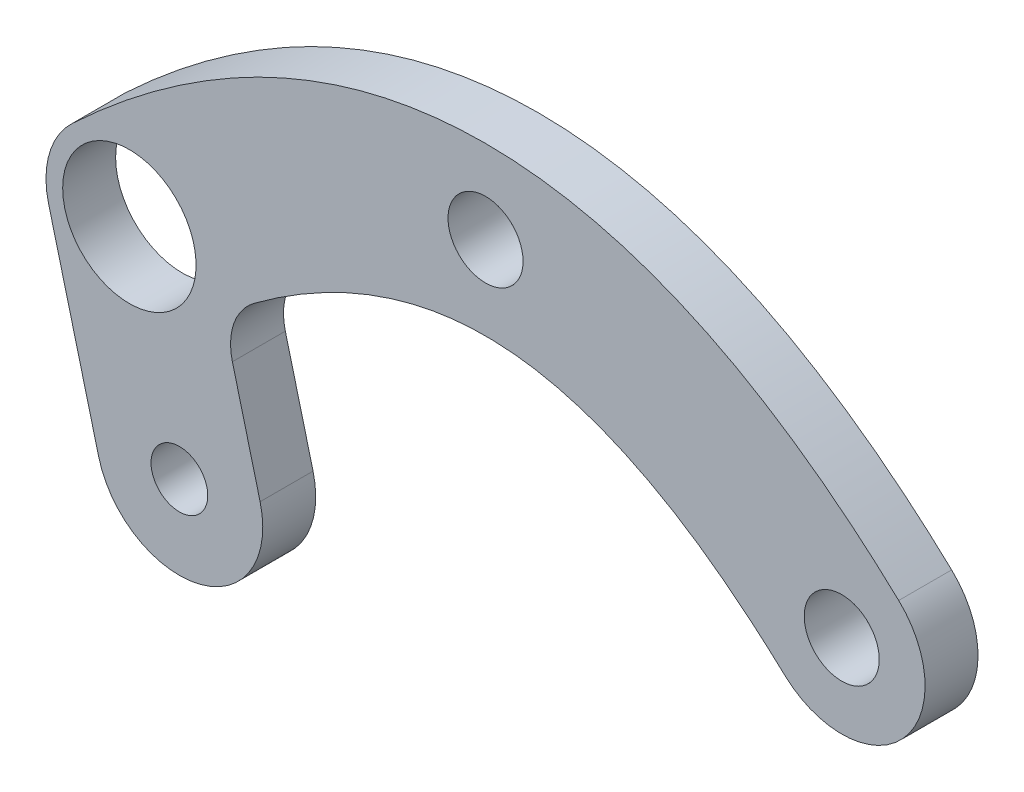
ISO-10303-21;
HEADER;
FILE_DESCRIPTION(('STEP AP214'),'2;1');
FILE_NAME('part.step','',(''),(''),'','','');
FILE_SCHEMA(('AUTOMOTIVE_DESIGN { 1 0 10303 214 1 1 1 1 }'));
ENDSEC;
DATA;
#1=APPLICATION_CONTEXT('core data for automotive mechanical design processes');
#2=APPLICATION_PROTOCOL_DEFINITION('international standard','automotive_design',2000,#1);
#3=PRODUCT_CONTEXT('',#1,'mechanical');
#4=PRODUCT('Part','Part','',(#3));
#5=PRODUCT_RELATED_PRODUCT_CATEGORY('part','',(#4));
#6=PRODUCT_DEFINITION_FORMATION('','',#4);
#7=PRODUCT_DEFINITION_CONTEXT('part definition',#1,'design');
#8=PRODUCT_DEFINITION('design','',#6,#7);
#9=PRODUCT_DEFINITION_SHAPE('','',#8);
#10=(LENGTH_UNIT() NAMED_UNIT(*) SI_UNIT(.MILLI.,.METRE.));
#11=(NAMED_UNIT(*) PLANE_ANGLE_UNIT() SI_UNIT($,.RADIAN.));
#12=(NAMED_UNIT(*) SI_UNIT($,.STERADIAN.) SOLID_ANGLE_UNIT());
#13=UNCERTAINTY_MEASURE_WITH_UNIT(LENGTH_MEASURE(1.E-05),#10,'distance_accuracy_value','');
#14=(GEOMETRIC_REPRESENTATION_CONTEXT(3) GLOBAL_UNCERTAINTY_ASSIGNED_CONTEXT((#13)) GLOBAL_UNIT_ASSIGNED_CONTEXT((#10,
#11,#12)) REPRESENTATION_CONTEXT('',''));
#15=CARTESIAN_POINT('',(0.,0.,0.));
#16=DIRECTION('',(0.,0.,1.));
#17=DIRECTION('',(1.,0.,0.));
#18=AXIS2_PLACEMENT_3D('',#15,#16,#17);
#19=CARTESIAN_POINT('',(-21.36,-10.,1.5875));
#20=DIRECTION('',(0.,0.,-1.));
#21=DIRECTION('',(-1.,0.,0.));
#22=AXIS2_PLACEMENT_3D('',#19,#20,#21);
#23=CYLINDRICAL_SURFACE('',#22,5.);
#24=CARTESIAN_POINT('',(-21.36,-10.,-1.5875));
#25=DIRECTION('',(0.,0.,1.));
#26=DIRECTION('',(1.,0.,0.));
#27=AXIS2_PLACEMENT_3D('',#24,#25,#26);
#28=CIRCLE('',#27,5.);
#29=CARTESIAN_POINT('',(-26.2012291827593,-11.25,-1.5875));
#30=VERTEX_POINT('',#29);
#31=CARTESIAN_POINT('',(-24.7774314290993,-6.35018323372195,-1.5875));
#32=VERTEX_POINT('',#31);
#33=EDGE_CURVE('E130',#30,#32,#28,.F.);
#34=ORIENTED_EDGE('',*,*,#33,.F.);
#35=DIRECTION('',(0.,0.,-1.));
#36=VECTOR('',#35,1.);
#37=CARTESIAN_POINT('',(-26.2012291827593,-11.25,21.6150258635163));
#38=LINE('',#37,#36);
#39=CARTESIAN_POINT('',(-26.2012291827593,-11.25,1.5875));
#40=VERTEX_POINT('',#39);
#41=EDGE_CURVE('E118',#40,#30,#38,.T.);
#42=ORIENTED_EDGE('',*,*,#41,.F.);
#43=CARTESIAN_POINT('',(-21.36,-10.,1.5875));
#44=DIRECTION('',(0.,0.,1.));
#45=DIRECTION('',(1.,0.,0.));
#46=AXIS2_PLACEMENT_3D('',#43,#44,#45);
#47=CIRCLE('',#46,5.);
#48=CARTESIAN_POINT('',(-24.7774314290993,-6.35018323372195,1.5875));
#49=VERTEX_POINT('',#48);
#50=EDGE_CURVE('E128',#40,#49,#47,.F.);
#51=ORIENTED_EDGE('',*,*,#50,.T.);
#52=DIRECTION('',(0.,0.,-1.));
#53=VECTOR('',#52,1.);
#54=CARTESIAN_POINT('',(-24.7774314290993,-6.35018323372195,1.5875));
#55=LINE('',#54,#53);
#56=EDGE_CURVE('E174',#49,#32,#55,.T.);
#57=ORIENTED_EDGE('',*,*,#56,.T.);
#58=EDGE_LOOP('',(#34,#42,#51,#57));
#59=FACE_BOUND('',#58,.T.);
#60=ADVANCED_FACE('F49',(#59),#23,.T.);
#61=CARTESIAN_POINT('',(-17.9425685709007,-13.649816766278,1.5875));
#62=CARTESIAN_POINT('',(-14.2685695152053,-10.2286843129854,1.5875));
#63=CARTESIAN_POINT('',(-8.53005202111008,-6.88377787776774,1.5875));
#64=CARTESIAN_POINT('',(-4.17884967888289,-5.36413027981006,1.5875));
#65=CARTESIAN_POINT('',(0.,-4.87862324006331,1.5875));
#66=CARTESIAN_POINT('',(4.17884967888289,-5.36413027981006,1.5875));
#67=CARTESIAN_POINT('',(8.53005202111008,-6.88377787776774,1.5875));
#68=CARTESIAN_POINT('',(14.2685695152053,-10.2286843129854,1.5875));
#69=CARTESIAN_POINT('',(17.9425685709007,-13.649816766278,1.5875));
#70=B_SPLINE_CURVE_WITH_KNOTS('',2,(#61,#62,#63,#64,#65,#66,#67,#68,#69),.UNSPECIFIED.,.F.,.F.,
(3,1,1,1,1,1,1,3),(0.,0.1875,0.3125,0.4375,0.5625,0.6875,0.8125,1.),.UNSPECIFIED.);
#71=DIRECTION('',(0.,0.,-1.));
#72=VECTOR('',#71,1.);
#73=SURFACE_OF_LINEAR_EXTRUSION('',#70,#72);
#74=CARTESIAN_POINT('',(-13.8750452365153,-10.2430725469191,1.5875));
#75=VERTEX_POINT('',#74);
#76=CARTESIAN_POINT('',(17.9425685709007,-13.649816766278,1.5875));
#77=VERTEX_POINT('',#76);
#78=EDGE_CURVE('E137',#75,#77,#70,.T.);
#79=ORIENTED_EDGE('',*,*,#78,.F.);
#80=DIRECTION('',(0.,0.,-1.));
#81=VECTOR('',#80,1.);
#82=CARTESIAN_POINT('',(-13.8750452365153,-10.2430725469191,1.5875));
#83=LINE('',#82,#81);
#84=CARTESIAN_POINT('',(-13.8750452365153,-10.2430725469191,-1.5875));
#85=VERTEX_POINT('',#84);
#86=EDGE_CURVE('E202',#75,#85,#83,.T.);
#87=ORIENTED_EDGE('',*,*,#86,.T.);
#88=CARTESIAN_POINT('',(-17.9425685709007,-13.649816766278,-1.5875));
#89=CARTESIAN_POINT('',(-14.2685695152053,-10.2286843129854,-1.5875));
#90=CARTESIAN_POINT('',(-8.53005202111008,-6.88377787776774,-1.5875));
#91=CARTESIAN_POINT('',(-4.17884967888289,-5.36413027981006,-1.5875));
#92=CARTESIAN_POINT('',(0.,-4.87862324006331,-1.5875));
#93=CARTESIAN_POINT('',(4.17884967888289,-5.36413027981006,-1.5875));
#94=CARTESIAN_POINT('',(8.53005202111008,-6.88377787776774,-1.5875));
#95=CARTESIAN_POINT('',(14.2685695152053,-10.2286843129854,-1.5875));
#96=CARTESIAN_POINT('',(17.9425685709007,-13.649816766278,-1.5875));
#97=B_SPLINE_CURVE_WITH_KNOTS('',2,(#88,#89,#90,#91,#92,#93,#94,#95,#96),.UNSPECIFIED.,.F.,.F.,
(3,1,1,1,1,1,1,3),(0.,0.1875,0.3125,0.4375,0.5625,0.6875,0.8125,1.),.UNSPECIFIED.);
#98=CARTESIAN_POINT('',(17.9425685709007,-13.649816766278,-1.5875));
#99=VERTEX_POINT('',#98);
#100=EDGE_CURVE('E180',#85,#99,#97,.T.);
#101=ORIENTED_EDGE('',*,*,#100,.T.);
#102=DIRECTION('',(0.,0.,-1.));
#103=VECTOR('',#102,1.);
#104=CARTESIAN_POINT('',(17.9425685709007,-13.649816766278,1.5875));
#105=LINE('',#104,#103);
#106=EDGE_CURVE('E198',#77,#99,#105,.T.);
#107=ORIENTED_EDGE('',*,*,#106,.F.);
#108=EDGE_LOOP('',(#79,#87,#101,#107));
#109=FACE_BOUND('',#108,.T.);
#110=ADVANCED_FACE('F156',(#109),#73,.F.);
#111=CARTESIAN_POINT('',(-24.7774314290993,-6.35018323372195,1.5875));
#112=CARTESIAN_POINT('',(-20.4414304847947,-2.27131568701465,1.5875));
#113=CARTESIAN_POINT('',(-12.8299479788899,2.19627787776774,1.5875));
#114=CARTESIAN_POINT('',(-6.50115032111711,4.42663027981006,1.5875));
#115=CARTESIAN_POINT('',(0.,5.19112324006331,1.5875));
#116=CARTESIAN_POINT('',(6.50115032111711,4.42663027981006,1.5875));
#117=CARTESIAN_POINT('',(12.8299479788899,2.19627787776774,1.5875));
#118=CARTESIAN_POINT('',(20.4414304847947,-2.27131568701464,1.5875));
#119=CARTESIAN_POINT('',(24.7774314290993,-6.35018323372195,1.5875));
#120=B_SPLINE_CURVE_WITH_KNOTS('',2,(#111,#112,#113,#114,#115,#116,#117,#118,#119),
.UNSPECIFIED.,.F.,.F.,(3,1,1,1,1,1,1,3),(0.,0.1875,0.3125,0.4375,0.5625,0.6875,0.8125,1.),.UNSPECIFIED.);
#121=DIRECTION('',(0.,0.,-1.));
#122=VECTOR('',#121,1.);
#123=SURFACE_OF_LINEAR_EXTRUSION('',#120,#122);
#124=CARTESIAN_POINT('',(-24.7774314290993,-6.35018323372195,-1.5875));
#125=CARTESIAN_POINT('',(-20.4414304847947,-2.27131568701465,-1.5875));
#126=CARTESIAN_POINT('',(-12.8299479788899,2.19627787776774,-1.5875));
#127=CARTESIAN_POINT('',(-6.50115032111711,4.42663027981006,-1.5875));
#128=CARTESIAN_POINT('',(0.,5.19112324006331,-1.5875));
#129=CARTESIAN_POINT('',(6.50115032111711,4.42663027981006,-1.5875));
#130=CARTESIAN_POINT('',(12.8299479788899,2.19627787776774,-1.5875));
#131=CARTESIAN_POINT('',(20.4414304847947,-2.27131568701464,-1.5875));
#132=CARTESIAN_POINT('',(24.7774314290993,-6.35018323372195,-1.5875));
#133=B_SPLINE_CURVE_WITH_KNOTS('',2,(#124,#125,#126,#127,#128,#129,#130,#131,#132),
.UNSPECIFIED.,.F.,.F.,(3,1,1,1,1,1,1,3),(0.,0.1875,0.3125,0.4375,0.5625,0.6875,0.8125,1.),.UNSPECIFIED.);
#134=CARTESIAN_POINT('',(24.7774314290993,-6.35018323372195,-1.5875));
#135=VERTEX_POINT('',#134);
#136=EDGE_CURVE('E173',#32,#135,#133,.T.);
#137=ORIENTED_EDGE('',*,*,#136,.F.);
#138=ORIENTED_EDGE('',*,*,#56,.F.);
#139=CARTESIAN_POINT('',(24.7774314290993,-6.35018323372195,1.5875));
#140=VERTEX_POINT('',#139);
#141=EDGE_CURVE('E136',#49,#140,#120,.T.);
#142=ORIENTED_EDGE('',*,*,#141,.T.);
#143=DIRECTION('',(0.,0.,-1.));
#144=VECTOR('',#143,1.);
#145=CARTESIAN_POINT('',(24.7774314290993,-6.35018323372195,1.5875));
#146=LINE('',#145,#144);
#147=EDGE_CURVE('E176',#140,#135,#146,.T.);
#148=ORIENTED_EDGE('',*,*,#147,.T.);
#149=EDGE_LOOP('',(#137,#138,#142,#148));
#150=FACE_BOUND('',#149,.T.);
#151=ADVANCED_FACE('F160',(#150),#123,.T.);
#152=CARTESIAN_POINT('',(21.36,-10.,1.5875));
#153=DIRECTION('',(0.,0.,-1.));
#154=DIRECTION('',(-1.,0.,0.));
#155=AXIS2_PLACEMENT_3D('',#152,#153,#154);
#156=CYLINDRICAL_SURFACE('',#155,5.);
#157=CARTESIAN_POINT('',(21.36,-10.,-1.5875));
#158=DIRECTION('',(0.,0.,1.));
#159=DIRECTION('',(1.,0.,0.));
#160=AXIS2_PLACEMENT_3D('',#157,#158,#159);
#161=CIRCLE('',#160,5.);
#162=EDGE_CURVE('E141',#99,#135,#161,.T.);
#163=ORIENTED_EDGE('',*,*,#162,.T.);
#164=ORIENTED_EDGE('',*,*,#147,.F.);
#165=CARTESIAN_POINT('',(21.36,-10.,1.5875));
#166=DIRECTION('',(0.,0.,1.));
#167=DIRECTION('',(1.,0.,0.));
#168=AXIS2_PLACEMENT_3D('',#165,#166,#167);
#169=CIRCLE('',#168,5.);
#170=EDGE_CURVE('E139',#77,#140,#169,.T.);
#171=ORIENTED_EDGE('',*,*,#170,.F.);
#172=ORIENTED_EDGE('',*,*,#106,.T.);
#173=EDGE_LOOP('',(#163,#164,#171,#172));
#174=FACE_BOUND('',#173,.T.);
#175=ADVANCED_FACE('F162',(#174),#156,.T.);
#176=CARTESIAN_POINT('',(0.,0.,1.5875));
#177=DIRECTION('',(0.,0.,1.));
#178=DIRECTION('',(1.,0.,0.));
#179=AXIS2_PLACEMENT_3D('',#176,#177,#178);
#180=PLANE('',#179);
#181=CARTESIAN_POINT('',(-21.36,-10.,1.5875));
#182=DIRECTION('',(0.,0.,-1.));
#183=DIRECTION('',(-1.,0.,0.));
#184=AXIS2_PLACEMENT_3D('',#181,#182,#183);
#185=CIRCLE('',#184,4.);
#186=CARTESIAN_POINT('',(-25.36,-10.,1.5875));
#187=VERTEX_POINT('',#186);
#188=EDGE_CURVE('E258',#187,#187,#185,.T.);
#189=ORIENTED_EDGE('',*,*,#188,.T.);
#190=EDGE_LOOP('',(#189));
#191=FACE_BOUND('',#190,.T.);
#192=CARTESIAN_POINT('',(-18.36,-21.6189500386222,1.5875));
#193=DIRECTION('',(0.,0.,-1.));
#194=DIRECTION('',(-1.,0.,0.));
#195=AXIS2_PLACEMENT_3D('',#192,#193,#194);
#196=CIRCLE('',#195,1.7);
#197=CARTESIAN_POINT('',(-20.06,-21.6189500386222,1.5875));
#198=VERTEX_POINT('',#197);
#199=EDGE_CURVE('E124',#198,#198,#196,.T.);
#200=ORIENTED_EDGE('',*,*,#199,.T.);
#201=EDGE_LOOP('',(#200));
#202=FACE_BOUND('',#201,.T.);
#203=DIRECTION('',(-0.25,0.968245836551854,0.));
#204=VECTOR('',#203,1.);
#205=CARTESIAN_POINT('',(-17.6043854086204,-4.5454327671869,1.5875));
#206=LINE('',#205,#204);
#207=CARTESIAN_POINT('',(-13.5187708172407,-20.3689500386223,1.5875));
#208=VERTEX_POINT('',#207);
#209=CARTESIAN_POINT('',(-15.1810762895118,-13.9308686282069,1.5875));
#210=VERTEX_POINT('',#209);
#211=EDGE_CURVE('E213',#208,#210,#206,.T.);
#212=ORIENTED_EDGE('',*,*,#211,.T.);
#213=CARTESIAN_POINT('',(-11.7922158615803,-13.0558686282069,1.5875));
#214=DIRECTION('',(0.,0.,1.));
#215=DIRECTION('',(1.,0.,0.));
#216=AXIS2_PLACEMENT_3D('',#213,#214,#215);
#217=CIRCLE('',#216,3.5);
#218=EDGE_CURVE('E11',#210,#75,#217,.F.);
#219=ORIENTED_EDGE('',*,*,#218,.T.);
#220=ORIENTED_EDGE('',*,*,#78,.T.);
#221=ORIENTED_EDGE('',*,*,#170,.T.);
#222=ORIENTED_EDGE('',*,*,#141,.F.);
#223=ORIENTED_EDGE('',*,*,#50,.F.);
#224=DIRECTION('',(-0.25,0.968245836551854,0.));
#225=VECTOR('',#224,1.);
#226=CARTESIAN_POINT('',(-27.2868437741389,-7.0454327671869,1.5875));
#227=LINE('',#226,#225);
#228=CARTESIAN_POINT('',(-23.2012291827593,-22.8689500386223,1.5875));
#229=VERTEX_POINT('',#228);
#230=EDGE_CURVE('E114',#229,#40,#227,.T.);
#231=ORIENTED_EDGE('',*,*,#230,.F.);
#232=CARTESIAN_POINT('',(-18.36,-21.6189500386222,1.5875));
#233=DIRECTION('',(0.,0.,1.));
#234=DIRECTION('',(1.,0.,0.));
#235=AXIS2_PLACEMENT_3D('',#232,#233,#234);
#236=CIRCLE('',#235,5.);
#237=EDGE_CURVE('E268',#229,#208,#236,.T.);
#238=ORIENTED_EDGE('',*,*,#237,.T.);
#239=EDGE_LOOP('',(#212,#219,#220,#221,#222,#223,#231,#238));
#240=FACE_BOUND('',#239,.T.);
#241=CARTESIAN_POINT('',(21.36,-10.,1.5875));
#242=DIRECTION('',(0.,0.,1.));
#243=DIRECTION('',(1.,0.,0.));
#244=AXIS2_PLACEMENT_3D('',#241,#242,#243);
#245=CIRCLE('',#244,2.24999999999999);
#246=CARTESIAN_POINT('',(23.61,-10.,1.5875));
#247=VERTEX_POINT('',#246);
#248=EDGE_CURVE('E276',#247,#247,#245,.T.);
#249=ORIENTED_EDGE('',*,*,#248,.F.);
#250=EDGE_LOOP('',(#249));
#251=FACE_BOUND('',#250,.T.);
#252=CARTESIAN_POINT('',(0.,0.,1.5875));
#253=DIRECTION('',(0.,0.,1.));
#254=DIRECTION('',(1.,0.,0.));
#255=AXIS2_PLACEMENT_3D('',#252,#253,#254);
#256=CIRCLE('',#255,2.24999999999999);
#257=CARTESIAN_POINT('',(2.24999999999999,0.,1.5875));
#258=VERTEX_POINT('',#257);
#259=EDGE_CURVE('E183',#258,#258,#256,.T.);
#260=ORIENTED_EDGE('',*,*,#259,.F.);
#261=EDGE_LOOP('',(#260));
#262=FACE_BOUND('',#261,.T.);
#263=ADVANCED_FACE('F133',(#191,#202,#240,#251,#262),#180,.T.);
#264=CARTESIAN_POINT('',(0.,0.,-1.5875));
#265=DIRECTION('',(0.,0.,1.));
#266=DIRECTION('',(1.,0.,0.));
#267=AXIS2_PLACEMENT_3D('',#264,#265,#266);
#268=PLANE('',#267);
#269=CARTESIAN_POINT('',(-21.36,-10.,-1.5875));
#270=DIRECTION('',(0.,0.,-1.));
#271=DIRECTION('',(-1.,0.,0.));
#272=AXIS2_PLACEMENT_3D('',#269,#270,#271);
#273=CIRCLE('',#272,4.);
#274=CARTESIAN_POINT('',(-25.36,-10.,-1.5875));
#275=VERTEX_POINT('',#274);
#276=EDGE_CURVE('E253',#275,#275,#273,.T.);
#277=ORIENTED_EDGE('',*,*,#276,.F.);
#278=EDGE_LOOP('',(#277));
#279=FACE_BOUND('',#278,.T.);
#280=CARTESIAN_POINT('',(-18.36,-21.6189500386222,-1.5875));
#281=DIRECTION('',(0.,0.,-1.));
#282=DIRECTION('',(-1.,0.,0.));
#283=AXIS2_PLACEMENT_3D('',#280,#281,#282);
#284=CIRCLE('',#283,1.69999999999999);
#285=CARTESIAN_POINT('',(-20.06,-21.6189500386222,-1.5875));
#286=VERTEX_POINT('',#285);
#287=EDGE_CURVE('E256',#286,#286,#284,.T.);
#288=ORIENTED_EDGE('',*,*,#287,.F.);
#289=EDGE_LOOP('',(#288));
#290=FACE_BOUND('',#289,.T.);
#291=ORIENTED_EDGE('',*,*,#100,.F.);
#292=CARTESIAN_POINT('',(-11.7922158615803,-13.0558686282069,-1.5875));
#293=DIRECTION('',(0.,0.,1.));
#294=DIRECTION('',(1.,0.,0.));
#295=AXIS2_PLACEMENT_3D('',#292,#293,#294);
#296=CIRCLE('',#295,3.5);
#297=CARTESIAN_POINT('',(-15.1810762895118,-13.9308686282069,-1.5875));
#298=VERTEX_POINT('',#297);
#299=EDGE_CURVE('E57',#85,#298,#296,.T.);
#300=ORIENTED_EDGE('',*,*,#299,.T.);
#301=DIRECTION('',(-0.25,0.968245836551854,0.));
#302=VECTOR('',#301,1.);
#303=CARTESIAN_POINT('',(-17.6043854086204,-4.5454327671869,-1.5875));
#304=LINE('',#303,#302);
#305=CARTESIAN_POINT('',(-13.5187708172407,-20.3689500386223,-1.5875));
#306=VERTEX_POINT('',#305);
#307=EDGE_CURVE('E269',#306,#298,#304,.T.);
#308=ORIENTED_EDGE('',*,*,#307,.F.);
#309=CARTESIAN_POINT('',(-18.36,-21.6189500386222,-1.5875));
#310=DIRECTION('',(0.,0.,-1.));
#311=DIRECTION('',(-1.,0.,0.));
#312=AXIS2_PLACEMENT_3D('',#309,#310,#311);
#313=CIRCLE('',#312,5.);
#314=CARTESIAN_POINT('',(-23.2012291827593,-22.8689500386223,-1.5875));
#315=VERTEX_POINT('',#314);
#316=EDGE_CURVE('E270',#315,#306,#313,.F.);
#317=ORIENTED_EDGE('',*,*,#316,.F.);
#318=DIRECTION('',(-0.25,0.968245836551854,0.));
#319=VECTOR('',#318,1.);
#320=CARTESIAN_POINT('',(-27.2868437741389,-7.0454327671869,-1.5875));
#321=LINE('',#320,#319);
#322=EDGE_CURVE('E266',#315,#30,#321,.T.);
#323=ORIENTED_EDGE('',*,*,#322,.T.);
#324=ORIENTED_EDGE('',*,*,#33,.T.);
#325=ORIENTED_EDGE('',*,*,#136,.T.);
#326=ORIENTED_EDGE('',*,*,#162,.F.);
#327=EDGE_LOOP('',(#291,#300,#308,#317,#323,#324,#325,#326));
#328=FACE_BOUND('',#327,.T.);
#329=CARTESIAN_POINT('',(21.36,-10.,-1.5875));
#330=DIRECTION('',(0.,0.,1.));
#331=DIRECTION('',(1.,0.,0.));
#332=AXIS2_PLACEMENT_3D('',#329,#330,#331);
#333=CIRCLE('',#332,2.25);
#334=CARTESIAN_POINT('',(23.61,-10.,-1.5875));
#335=VERTEX_POINT('',#334);
#336=EDGE_CURVE('E282',#335,#335,#333,.T.);
#337=ORIENTED_EDGE('',*,*,#336,.T.);
#338=EDGE_LOOP('',(#337));
#339=FACE_BOUND('',#338,.T.);
#340=CARTESIAN_POINT('',(0.,0.,-1.5875));
#341=DIRECTION('',(0.,0.,1.));
#342=DIRECTION('',(1.,0.,0.));
#343=AXIS2_PLACEMENT_3D('',#340,#341,#342);
#344=CIRCLE('',#343,2.25);
#345=CARTESIAN_POINT('',(2.25,0.,-1.5875));
#346=VERTEX_POINT('',#345);
#347=EDGE_CURVE('E179',#346,#346,#344,.T.);
#348=ORIENTED_EDGE('',*,*,#347,.T.);
#349=EDGE_LOOP('',(#348));
#350=FACE_BOUND('',#349,.T.);
#351=ADVANCED_FACE('F210',(#279,#290,#328,#339,#350),#268,.F.);
#352=CARTESIAN_POINT('',(0.,0.,1.5875));
#353=DIRECTION('',(0.,0.,1.));
#354=DIRECTION('',(1.,0.,0.));
#355=AXIS2_PLACEMENT_3D('',#352,#353,#354);
#356=CYLINDRICAL_SURFACE('',#355,2.24999999999999);
#357=ORIENTED_EDGE('',*,*,#347,.F.);
#358=EDGE_LOOP('',(#357));
#359=FACE_BOUND('',#358,.T.);
#360=ORIENTED_EDGE('',*,*,#259,.T.);
#361=EDGE_LOOP('',(#360));
#362=FACE_BOUND('',#361,.T.);
#363=ADVANCED_FACE('F238',(#359,#362),#356,.F.);
#364=CARTESIAN_POINT('',(21.36,-10.,1.5875));
#365=DIRECTION('',(0.,0.,1.));
#366=DIRECTION('',(1.,0.,0.));
#367=AXIS2_PLACEMENT_3D('',#364,#365,#366);
#368=CYLINDRICAL_SURFACE('',#367,2.24999999999999);
#369=ORIENTED_EDGE('',*,*,#336,.F.);
#370=EDGE_LOOP('',(#369));
#371=FACE_BOUND('',#370,.T.);
#372=ORIENTED_EDGE('',*,*,#248,.T.);
#373=EDGE_LOOP('',(#372));
#374=FACE_BOUND('',#373,.T.);
#375=ADVANCED_FACE('F235',(#371,#374),#368,.F.);
#376=CARTESIAN_POINT('',(-27.2868437741389,-7.0454327671869,21.6150258635163));
#377=DIRECTION('',(-0.968245836551854,-0.25,0.));
#378=DIRECTION('',(0.25,-0.968245836551854,0.));
#379=AXIS2_PLACEMENT_3D('',#376,#377,#378);
#380=PLANE('',#379);
#381=DIRECTION('',(0.,0.,-1.));
#382=VECTOR('',#381,1.);
#383=CARTESIAN_POINT('',(-23.2012291827593,-22.8689500386223,21.6150258635163));
#384=LINE('',#383,#382);
#385=EDGE_CURVE('E120',#229,#315,#384,.T.);
#386=ORIENTED_EDGE('',*,*,#385,.F.);
#387=ORIENTED_EDGE('',*,*,#230,.T.);
#388=ORIENTED_EDGE('',*,*,#41,.T.);
#389=ORIENTED_EDGE('',*,*,#322,.F.);
#390=EDGE_LOOP('',(#386,#387,#388,#389));
#391=FACE_BOUND('',#390,.T.);
#392=ADVANCED_FACE('F116',(#391),#380,.T.);
#393=CARTESIAN_POINT('',(-18.36,-21.6189500386222,21.6150258635163));
#394=DIRECTION('',(0.,0.,-1.));
#395=DIRECTION('',(-1.,0.,0.));
#396=AXIS2_PLACEMENT_3D('',#393,#394,#395);
#397=CYLINDRICAL_SURFACE('',#396,5.);
#398=ORIENTED_EDGE('',*,*,#237,.F.);
#399=ORIENTED_EDGE('',*,*,#385,.T.);
#400=ORIENTED_EDGE('',*,*,#316,.T.);
#401=DIRECTION('',(0.,0.,-1.));
#402=VECTOR('',#401,1.);
#403=CARTESIAN_POINT('',(-13.5187708172407,-20.3689500386223,21.6150258635163));
#404=LINE('',#403,#402);
#405=EDGE_CURVE('E273',#208,#306,#404,.T.);
#406=ORIENTED_EDGE('',*,*,#405,.F.);
#407=EDGE_LOOP('',(#398,#399,#400,#406));
#408=FACE_BOUND('',#407,.T.);
#409=ADVANCED_FACE('F224',(#408),#397,.T.);
#410=CARTESIAN_POINT('',(-17.6043854086204,-4.5454327671869,21.6150258635163));
#411=DIRECTION('',(-0.968245836551854,-0.25,0.));
#412=DIRECTION('',(0.25,-0.968245836551854,0.));
#413=AXIS2_PLACEMENT_3D('',#410,#411,#412);
#414=PLANE('',#413);
#415=ORIENTED_EDGE('',*,*,#307,.T.);
#416=DIRECTION('',(0.,0.,1.));
#417=VECTOR('',#416,1.);
#418=CARTESIAN_POINT('',(-15.1810762895118,-13.9308686282069,1.5875));
#419=LINE('',#418,#417);
#420=EDGE_CURVE('E70',#298,#210,#419,.T.);
#421=ORIENTED_EDGE('',*,*,#420,.T.);
#422=ORIENTED_EDGE('',*,*,#211,.F.);
#423=ORIENTED_EDGE('',*,*,#405,.T.);
#424=EDGE_LOOP('',(#415,#421,#422,#423));
#425=FACE_BOUND('',#424,.T.);
#426=ADVANCED_FACE('F216',(#425),#414,.F.);
#427=CARTESIAN_POINT('',(-11.7922158615803,-13.0558686282069,0.));
#428=DIRECTION('',(0.,0.,-1.));
#429=DIRECTION('',(-1.,0.,0.));
#430=AXIS2_PLACEMENT_3D('',#427,#428,#429);
#431=CYLINDRICAL_SURFACE('',#430,3.5);
#432=ORIENTED_EDGE('',*,*,#218,.F.);
#433=ORIENTED_EDGE('',*,*,#420,.F.);
#434=ORIENTED_EDGE('',*,*,#299,.F.);
#435=ORIENTED_EDGE('',*,*,#86,.F.);
#436=EDGE_LOOP('',(#432,#433,#434,#435));
#437=FACE_BOUND('',#436,.T.);
#438=ADVANCED_FACE('F51',(#437),#431,.F.);
#439=CARTESIAN_POINT('',(-18.36,-21.6189500386222,-1.5875));
#440=DIRECTION('',(0.,0.,-1.));
#441=DIRECTION('',(-1.,0.,0.));
#442=AXIS2_PLACEMENT_3D('',#439,#440,#441);
#443=CYLINDRICAL_SURFACE('',#442,1.69999999999999);
#444=ORIENTED_EDGE('',*,*,#199,.F.);
#445=EDGE_LOOP('',(#444));
#446=FACE_BOUND('',#445,.T.);
#447=ORIENTED_EDGE('',*,*,#287,.T.);
#448=EDGE_LOOP('',(#447));
#449=FACE_BOUND('',#448,.T.);
#450=ADVANCED_FACE('F215',(#446,#449),#443,.F.);
#451=CARTESIAN_POINT('',(-21.36,-10.,1.5875));
#452=DIRECTION('',(0.,0.,-1.));
#453=DIRECTION('',(-1.,0.,0.));
#454=AXIS2_PLACEMENT_3D('',#451,#452,#453);
#455=CYLINDRICAL_SURFACE('',#454,4.);
#456=ORIENTED_EDGE('',*,*,#188,.F.);
#457=EDGE_LOOP('',(#456));
#458=FACE_BOUND('',#457,.T.);
#459=ORIENTED_EDGE('',*,*,#276,.T.);
#460=EDGE_LOOP('',(#459));
#461=FACE_BOUND('',#460,.T.);
#462=ADVANCED_FACE('F221',(#458,#461),#455,.F.);
#463=CLOSED_SHELL('',(#60,#110,#151,#175,#263,#351,#363,#375,#392,#409,#426,#438,#450,#462));
#464=MANIFOLD_SOLID_BREP('B2',#463);
#465=ADVANCED_BREP_SHAPE_REPRESENTATION('',(#18,#464),#14);
#466=SHAPE_DEFINITION_REPRESENTATION(#9,#465);
ENDSEC;
END-ISO-10303-21;
